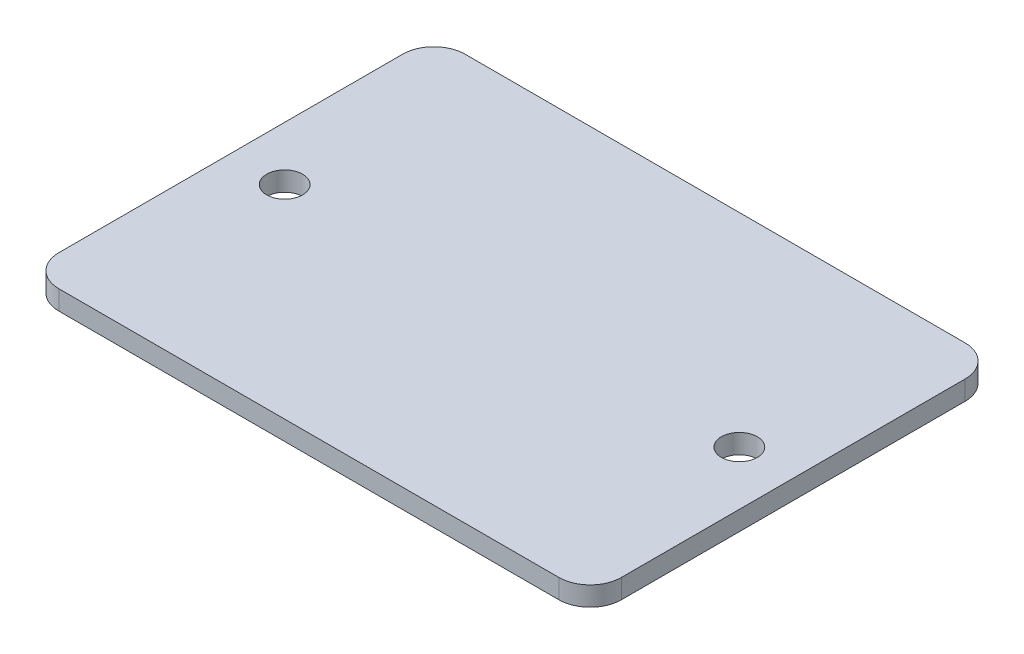
ISO-10303-21;
HEADER;
FILE_DESCRIPTION(('STEP AP214'),'2;1');
FILE_NAME('part.step','',(''),(''),'','','');
FILE_SCHEMA(('AUTOMOTIVE_DESIGN { 1 0 10303 214 1 1 1 1 }'));
ENDSEC;
DATA;
#1=APPLICATION_CONTEXT('core data for automotive mechanical design processes');
#2=APPLICATION_PROTOCOL_DEFINITION('international standard','automotive_design',2000,#1);
#3=PRODUCT_CONTEXT('',#1,'mechanical');
#4=PRODUCT('Part','Part','',(#3));
#5=PRODUCT_RELATED_PRODUCT_CATEGORY('part','',(#4));
#6=PRODUCT_DEFINITION_FORMATION('','',#4);
#7=PRODUCT_DEFINITION_CONTEXT('part definition',#1,'design');
#8=PRODUCT_DEFINITION('design','',#6,#7);
#9=PRODUCT_DEFINITION_SHAPE('','',#8);
#10=(LENGTH_UNIT() NAMED_UNIT(*) SI_UNIT(.MILLI.,.METRE.));
#11=(NAMED_UNIT(*) PLANE_ANGLE_UNIT() SI_UNIT($,.RADIAN.));
#12=(NAMED_UNIT(*) SI_UNIT($,.STERADIAN.) SOLID_ANGLE_UNIT());
#13=UNCERTAINTY_MEASURE_WITH_UNIT(LENGTH_MEASURE(1.E-05),#10,'distance_accuracy_value','');
#14=(GEOMETRIC_REPRESENTATION_CONTEXT(3) GLOBAL_UNCERTAINTY_ASSIGNED_CONTEXT((#13)) GLOBAL_UNIT_ASSIGNED_CONTEXT((#10,
#11,#12)) REPRESENTATION_CONTEXT('',''));
#15=CARTESIAN_POINT('',(0.,0.,0.));
#16=DIRECTION('',(0.,0.,1.));
#17=DIRECTION('',(1.,0.,0.));
#18=AXIS2_PLACEMENT_3D('',#15,#16,#17);
#19=CARTESIAN_POINT('',(-22.86,1.5748,16.51));
#20=DIRECTION('',(1.,0.,0.));
#21=DIRECTION('',(0.,0.,-1.));
#22=AXIS2_PLACEMENT_3D('',#19,#20,#21);
#23=PLANE('',#22);
#24=DIRECTION('',(0.,0.,1.));
#25=VECTOR('',#24,1.);
#26=CARTESIAN_POINT('',(-22.86,1.5748,16.51));
#27=LINE('',#26,#25);
#28=CARTESIAN_POINT('',(-22.86,1.5748,-13.97));
#29=VERTEX_POINT('',#28);
#30=CARTESIAN_POINT('',(-22.86,1.5748,13.97));
#31=VERTEX_POINT('',#30);
#32=EDGE_CURVE('E119',#29,#31,#27,.T.);
#33=ORIENTED_EDGE('',*,*,#32,.F.);
#34=DIRECTION('',(0.,-1.,0.));
#35=VECTOR('',#34,1.);
#36=CARTESIAN_POINT('',(-22.86,1.5748,-13.97));
#37=LINE('',#36,#35);
#38=CARTESIAN_POINT('',(-22.86,0.,-13.97));
#39=VERTEX_POINT('',#38);
#40=EDGE_CURVE('E104',#29,#39,#37,.T.);
#41=ORIENTED_EDGE('',*,*,#40,.T.);
#42=DIRECTION('',(0.,0.,1.));
#43=VECTOR('',#42,1.);
#44=CARTESIAN_POINT('',(-22.86,0.,16.51));
#45=LINE('',#44,#43);
#46=CARTESIAN_POINT('',(-22.86,0.,13.97));
#47=VERTEX_POINT('',#46);
#48=EDGE_CURVE('E116',#39,#47,#45,.T.);
#49=ORIENTED_EDGE('',*,*,#48,.T.);
#50=DIRECTION('',(0.,-1.,0.));
#51=VECTOR('',#50,1.);
#52=CARTESIAN_POINT('',(-22.86,1.5748,13.97));
#53=LINE('',#52,#51);
#54=EDGE_CURVE('E121',#47,#31,#53,.F.);
#55=ORIENTED_EDGE('',*,*,#54,.T.);
#56=EDGE_LOOP('',(#33,#41,#49,#55));
#57=FACE_BOUND('',#56,.T.);
#58=ADVANCED_FACE('F34',(#57),#23,.F.);
#59=CARTESIAN_POINT('',(22.86,1.5748,16.51));
#60=DIRECTION('',(0.,0.,-1.));
#61=DIRECTION('',(-1.,0.,0.));
#62=AXIS2_PLACEMENT_3D('',#59,#60,#61);
#63=PLANE('',#62);
#64=DIRECTION('',(1.,0.,0.));
#65=VECTOR('',#64,1.);
#66=CARTESIAN_POINT('',(22.86,0.,16.51));
#67=LINE('',#66,#65);
#68=CARTESIAN_POINT('',(-20.32,0.,16.51));
#69=VERTEX_POINT('',#68);
#70=CARTESIAN_POINT('',(20.32,0.,16.51));
#71=VERTEX_POINT('',#70);
#72=EDGE_CURVE('E125',#69,#71,#67,.T.);
#73=ORIENTED_EDGE('',*,*,#72,.T.);
#74=DIRECTION('',(0.,-1.,0.));
#75=VECTOR('',#74,1.);
#76=CARTESIAN_POINT('',(20.32,1.5748,16.51));
#77=LINE('',#76,#75);
#78=CARTESIAN_POINT('',(20.32,1.5748,16.51));
#79=VERTEX_POINT('',#78);
#80=EDGE_CURVE('E11',#71,#79,#77,.F.);
#81=ORIENTED_EDGE('',*,*,#80,.T.);
#82=DIRECTION('',(1.,0.,0.));
#83=VECTOR('',#82,1.);
#84=CARTESIAN_POINT('',(22.86,1.5748,16.51));
#85=LINE('',#84,#83);
#86=CARTESIAN_POINT('',(-20.32,1.5748,16.51));
#87=VERTEX_POINT('',#86);
#88=EDGE_CURVE('E165',#87,#79,#85,.T.);
#89=ORIENTED_EDGE('',*,*,#88,.F.);
#90=DIRECTION('',(0.,-1.,0.));
#91=VECTOR('',#90,1.);
#92=CARTESIAN_POINT('',(-20.32,1.5748,16.51));
#93=LINE('',#92,#91);
#94=EDGE_CURVE('E42',#87,#69,#93,.T.);
#95=ORIENTED_EDGE('',*,*,#94,.T.);
#96=EDGE_LOOP('',(#73,#81,#89,#95));
#97=FACE_BOUND('',#96,.T.);
#98=ADVANCED_FACE('F163',(#97),#63,.F.);
#99=CARTESIAN_POINT('',(22.86,1.5748,16.51));
#100=DIRECTION('',(-1.,0.,0.));
#101=DIRECTION('',(0.,0.,1.));
#102=AXIS2_PLACEMENT_3D('',#99,#100,#101);
#103=PLANE('',#102);
#104=DIRECTION('',(0.,0.,-1.));
#105=VECTOR('',#104,1.);
#106=CARTESIAN_POINT('',(22.86,0.,16.51));
#107=LINE('',#106,#105);
#108=CARTESIAN_POINT('',(22.86,0.,13.97));
#109=VERTEX_POINT('',#108);
#110=CARTESIAN_POINT('',(22.86,0.,-13.97));
#111=VERTEX_POINT('',#110);
#112=EDGE_CURVE('E129',#109,#111,#107,.T.);
#113=ORIENTED_EDGE('',*,*,#112,.T.);
#114=DIRECTION('',(0.,-1.,0.));
#115=VECTOR('',#114,1.);
#116=CARTESIAN_POINT('',(22.86,1.5748,-13.97));
#117=LINE('',#116,#115);
#118=CARTESIAN_POINT('',(22.86,1.5748,-13.97));
#119=VERTEX_POINT('',#118);
#120=EDGE_CURVE('E49',#111,#119,#117,.F.);
#121=ORIENTED_EDGE('',*,*,#120,.T.);
#122=DIRECTION('',(0.,0.,-1.));
#123=VECTOR('',#122,1.);
#124=CARTESIAN_POINT('',(22.86,1.5748,16.51));
#125=LINE('',#124,#123);
#126=CARTESIAN_POINT('',(22.86,1.5748,13.97));
#127=VERTEX_POINT('',#126);
#128=EDGE_CURVE('E173',#127,#119,#125,.T.);
#129=ORIENTED_EDGE('',*,*,#128,.F.);
#130=DIRECTION('',(0.,-1.,0.));
#131=VECTOR('',#130,1.);
#132=CARTESIAN_POINT('',(22.86,1.5748,13.97));
#133=LINE('',#132,#131);
#134=EDGE_CURVE('E156',#127,#109,#133,.T.);
#135=ORIENTED_EDGE('',*,*,#134,.T.);
#136=EDGE_LOOP('',(#113,#121,#129,#135));
#137=FACE_BOUND('',#136,.T.);
#138=ADVANCED_FACE('F172',(#137),#103,.F.);
#139=CARTESIAN_POINT('',(22.86,1.5748,-16.51));
#140=DIRECTION('',(0.,0.,1.));
#141=DIRECTION('',(1.,0.,0.));
#142=AXIS2_PLACEMENT_3D('',#139,#140,#141);
#143=PLANE('',#142);
#144=DIRECTION('',(-1.,0.,0.));
#145=VECTOR('',#144,1.);
#146=CARTESIAN_POINT('',(22.86,0.,-16.51));
#147=LINE('',#146,#145);
#148=CARTESIAN_POINT('',(20.32,0.,-16.51));
#149=VERTEX_POINT('',#148);
#150=CARTESIAN_POINT('',(-20.32,0.,-16.51));
#151=VERTEX_POINT('',#150);
#152=EDGE_CURVE('E139',#149,#151,#147,.T.);
#153=ORIENTED_EDGE('',*,*,#152,.T.);
#154=DIRECTION('',(0.,-1.,0.));
#155=VECTOR('',#154,1.);
#156=CARTESIAN_POINT('',(-20.32,1.5748,-16.51));
#157=LINE('',#156,#155);
#158=CARTESIAN_POINT('',(-20.32,1.5748,-16.51));
#159=VERTEX_POINT('',#158);
#160=EDGE_CURVE('E105',#151,#159,#157,.F.);
#161=ORIENTED_EDGE('',*,*,#160,.T.);
#162=DIRECTION('',(-1.,0.,0.));
#163=VECTOR('',#162,1.);
#164=CARTESIAN_POINT('',(22.86,1.5748,-16.51));
#165=LINE('',#164,#163);
#166=CARTESIAN_POINT('',(20.32,1.5748,-16.51));
#167=VERTEX_POINT('',#166);
#168=EDGE_CURVE('E135',#167,#159,#165,.T.);
#169=ORIENTED_EDGE('',*,*,#168,.F.);
#170=DIRECTION('',(0.,-1.,0.));
#171=VECTOR('',#170,1.);
#172=CARTESIAN_POINT('',(20.32,1.5748,-16.51));
#173=LINE('',#172,#171);
#174=EDGE_CURVE('E110',#167,#149,#173,.T.);
#175=ORIENTED_EDGE('',*,*,#174,.T.);
#176=EDGE_LOOP('',(#153,#161,#169,#175));
#177=FACE_BOUND('',#176,.T.);
#178=ADVANCED_FACE('F193',(#177),#143,.F.);
#179=CARTESIAN_POINT('',(0.,1.5748,0.));
#180=DIRECTION('',(0.,1.,0.));
#181=DIRECTION('',(0.,0.,1.));
#182=AXIS2_PLACEMENT_3D('',#179,#180,#181);
#183=PLANE('',#182);
#184=CARTESIAN_POINT('',(-18.4785,1.5748,0.));
#185=DIRECTION('',(0.,1.,0.));
#186=DIRECTION('',(0.,0.,1.));
#187=AXIS2_PLACEMENT_3D('',#184,#185,#186);
#188=CIRCLE('',#187,1.4605);
#189=CARTESIAN_POINT('',(-18.4785,1.5748,1.4605));
#190=VERTEX_POINT('',#189);
#191=EDGE_CURVE('E132',#190,#190,#188,.T.);
#192=ORIENTED_EDGE('',*,*,#191,.F.);
#193=EDGE_LOOP('',(#192));
#194=FACE_BOUND('',#193,.T.);
#195=CARTESIAN_POINT('',(18.4785,1.5748,0.));
#196=DIRECTION('',(0.,1.,0.));
#197=DIRECTION('',(0.,0.,1.));
#198=AXIS2_PLACEMENT_3D('',#195,#196,#197);
#199=CIRCLE('',#198,1.4605);
#200=CARTESIAN_POINT('',(18.4785,1.5748,1.4605));
#201=VERTEX_POINT('',#200);
#202=EDGE_CURVE('E179',#201,#201,#199,.T.);
#203=ORIENTED_EDGE('',*,*,#202,.F.);
#204=EDGE_LOOP('',(#203));
#205=FACE_BOUND('',#204,.T.);
#206=ORIENTED_EDGE('',*,*,#168,.T.);
#207=CARTESIAN_POINT('',(-20.32,1.5748,-13.97));
#208=DIRECTION('',(0.,1.,0.));
#209=DIRECTION('',(0.,0.,1.));
#210=AXIS2_PLACEMENT_3D('',#207,#208,#209);
#211=CIRCLE('',#210,2.54);
#212=EDGE_CURVE('E154',#159,#29,#211,.T.);
#213=ORIENTED_EDGE('',*,*,#212,.T.);
#214=ORIENTED_EDGE('',*,*,#32,.T.);
#215=CARTESIAN_POINT('',(-20.32,1.5748,13.97));
#216=DIRECTION('',(0.,1.,0.));
#217=DIRECTION('',(0.,0.,1.));
#218=AXIS2_PLACEMENT_3D('',#215,#216,#217);
#219=CIRCLE('',#218,2.54);
#220=EDGE_CURVE('E149',#31,#87,#219,.T.);
#221=ORIENTED_EDGE('',*,*,#220,.T.);
#222=ORIENTED_EDGE('',*,*,#88,.T.);
#223=CARTESIAN_POINT('',(20.32,1.5748,13.97));
#224=DIRECTION('',(0.,1.,0.));
#225=DIRECTION('',(0.,0.,1.));
#226=AXIS2_PLACEMENT_3D('',#223,#224,#225);
#227=CIRCLE('',#226,2.54);
#228=EDGE_CURVE('E56',#79,#127,#227,.T.);
#229=ORIENTED_EDGE('',*,*,#228,.T.);
#230=ORIENTED_EDGE('',*,*,#128,.T.);
#231=CARTESIAN_POINT('',(20.32,1.5748,-13.97));
#232=DIRECTION('',(0.,1.,0.));
#233=DIRECTION('',(0.,0.,1.));
#234=AXIS2_PLACEMENT_3D('',#231,#232,#233);
#235=CIRCLE('',#234,2.54);
#236=EDGE_CURVE('E152',#119,#167,#235,.T.);
#237=ORIENTED_EDGE('',*,*,#236,.T.);
#238=EDGE_LOOP('',(#206,#213,#214,#221,#222,#229,#230,#237));
#239=FACE_BOUND('',#238,.T.);
#240=ADVANCED_FACE('F190',(#194,#205,#239),#183,.T.);
#241=CARTESIAN_POINT('',(0.,0.,0.));
#242=DIRECTION('',(0.,1.,0.));
#243=DIRECTION('',(0.,0.,1.));
#244=AXIS2_PLACEMENT_3D('',#241,#242,#243);
#245=PLANE('',#244);
#246=CARTESIAN_POINT('',(-18.4785,0.,0.));
#247=DIRECTION('',(0.,1.,0.));
#248=DIRECTION('',(0.,0.,1.));
#249=AXIS2_PLACEMENT_3D('',#246,#247,#248);
#250=CIRCLE('',#249,1.4605);
#251=CARTESIAN_POINT('',(-18.4785,0.,1.4605));
#252=VERTEX_POINT('',#251);
#253=EDGE_CURVE('E126',#252,#252,#250,.T.);
#254=ORIENTED_EDGE('',*,*,#253,.T.);
#255=EDGE_LOOP('',(#254));
#256=FACE_BOUND('',#255,.T.);
#257=CARTESIAN_POINT('',(18.4785,0.,0.));
#258=DIRECTION('',(0.,1.,0.));
#259=DIRECTION('',(0.,0.,1.));
#260=AXIS2_PLACEMENT_3D('',#257,#258,#259);
#261=CIRCLE('',#260,1.4605);
#262=CARTESIAN_POINT('',(18.4785,0.,1.4605));
#263=VERTEX_POINT('',#262);
#264=EDGE_CURVE('E182',#263,#263,#261,.T.);
#265=ORIENTED_EDGE('',*,*,#264,.T.);
#266=EDGE_LOOP('',(#265));
#267=FACE_BOUND('',#266,.T.);
#268=ORIENTED_EDGE('',*,*,#48,.F.);
#269=CARTESIAN_POINT('',(-20.32,0.,-13.97));
#270=DIRECTION('',(0.,1.,0.));
#271=DIRECTION('',(0.,0.,1.));
#272=AXIS2_PLACEMENT_3D('',#269,#270,#271);
#273=CIRCLE('',#272,2.54);
#274=EDGE_CURVE('E100',#39,#151,#273,.F.);
#275=ORIENTED_EDGE('',*,*,#274,.T.);
#276=ORIENTED_EDGE('',*,*,#152,.F.);
#277=CARTESIAN_POINT('',(20.32,0.,-13.97));
#278=DIRECTION('',(0.,1.,0.));
#279=DIRECTION('',(0.,0.,1.));
#280=AXIS2_PLACEMENT_3D('',#277,#278,#279);
#281=CIRCLE('',#280,2.54);
#282=EDGE_CURVE('E111',#149,#111,#281,.F.);
#283=ORIENTED_EDGE('',*,*,#282,.T.);
#284=ORIENTED_EDGE('',*,*,#112,.F.);
#285=CARTESIAN_POINT('',(20.32,0.,13.97));
#286=DIRECTION('',(0.,1.,0.));
#287=DIRECTION('',(0.,0.,1.));
#288=AXIS2_PLACEMENT_3D('',#285,#286,#287);
#289=CIRCLE('',#288,2.54);
#290=EDGE_CURVE('E143',#109,#71,#289,.F.);
#291=ORIENTED_EDGE('',*,*,#290,.T.);
#292=ORIENTED_EDGE('',*,*,#72,.F.);
#293=CARTESIAN_POINT('',(-20.32,0.,13.97));
#294=DIRECTION('',(0.,1.,0.));
#295=DIRECTION('',(0.,0.,1.));
#296=AXIS2_PLACEMENT_3D('',#293,#294,#295);
#297=CIRCLE('',#296,2.54);
#298=EDGE_CURVE('E120',#69,#47,#297,.F.);
#299=ORIENTED_EDGE('',*,*,#298,.T.);
#300=EDGE_LOOP('',(#268,#275,#276,#283,#284,#291,#292,#299));
#301=FACE_BOUND('',#300,.T.);
#302=ADVANCED_FACE('F123',(#256,#267,#301),#245,.F.);
#303=CARTESIAN_POINT('',(-20.32,1.5748,-13.97));
#304=DIRECTION('',(0.,-1.,0.));
#305=DIRECTION('',(0.,0.,-1.));
#306=AXIS2_PLACEMENT_3D('',#303,#304,#305);
#307=CYLINDRICAL_SURFACE('',#306,2.54);
#308=ORIENTED_EDGE('',*,*,#212,.F.);
#309=ORIENTED_EDGE('',*,*,#160,.F.);
#310=ORIENTED_EDGE('',*,*,#274,.F.);
#311=ORIENTED_EDGE('',*,*,#40,.F.);
#312=EDGE_LOOP('',(#308,#309,#310,#311));
#313=FACE_BOUND('',#312,.T.);
#314=ADVANCED_FACE('F103',(#313),#307,.T.);
#315=CARTESIAN_POINT('',(20.32,1.5748,-13.97));
#316=DIRECTION('',(0.,-1.,0.));
#317=DIRECTION('',(0.,0.,-1.));
#318=AXIS2_PLACEMENT_3D('',#315,#316,#317);
#319=CYLINDRICAL_SURFACE('',#318,2.54);
#320=ORIENTED_EDGE('',*,*,#236,.F.);
#321=ORIENTED_EDGE('',*,*,#120,.F.);
#322=ORIENTED_EDGE('',*,*,#282,.F.);
#323=ORIENTED_EDGE('',*,*,#174,.F.);
#324=EDGE_LOOP('',(#320,#321,#322,#323));
#325=FACE_BOUND('',#324,.T.);
#326=ADVANCED_FACE('F200',(#325),#319,.T.);
#327=CARTESIAN_POINT('',(20.32,1.5748,13.97));
#328=DIRECTION('',(0.,-1.,0.));
#329=DIRECTION('',(0.,0.,-1.));
#330=AXIS2_PLACEMENT_3D('',#327,#328,#329);
#331=CYLINDRICAL_SURFACE('',#330,2.54);
#332=ORIENTED_EDGE('',*,*,#228,.F.);
#333=ORIENTED_EDGE('',*,*,#80,.F.);
#334=ORIENTED_EDGE('',*,*,#290,.F.);
#335=ORIENTED_EDGE('',*,*,#134,.F.);
#336=EDGE_LOOP('',(#332,#333,#334,#335));
#337=FACE_BOUND('',#336,.T.);
#338=ADVANCED_FACE('F171',(#337),#331,.T.);
#339=CARTESIAN_POINT('',(-20.32,1.5748,13.97));
#340=DIRECTION('',(0.,-1.,0.));
#341=DIRECTION('',(0.,0.,-1.));
#342=AXIS2_PLACEMENT_3D('',#339,#340,#341);
#343=CYLINDRICAL_SURFACE('',#342,2.54);
#344=ORIENTED_EDGE('',*,*,#220,.F.);
#345=ORIENTED_EDGE('',*,*,#54,.F.);
#346=ORIENTED_EDGE('',*,*,#298,.F.);
#347=ORIENTED_EDGE('',*,*,#94,.F.);
#348=EDGE_LOOP('',(#344,#345,#346,#347));
#349=FACE_BOUND('',#348,.T.);
#350=ADVANCED_FACE('F36',(#349),#343,.T.);
#351=CARTESIAN_POINT('',(18.4785,0.,0.));
#352=DIRECTION('',(0.,1.,0.));
#353=DIRECTION('',(0.,0.,1.));
#354=AXIS2_PLACEMENT_3D('',#351,#352,#353);
#355=CYLINDRICAL_SURFACE('',#354,1.4605);
#356=ORIENTED_EDGE('',*,*,#264,.F.);
#357=EDGE_LOOP('',(#356));
#358=FACE_BOUND('',#357,.T.);
#359=ORIENTED_EDGE('',*,*,#202,.T.);
#360=EDGE_LOOP('',(#359));
#361=FACE_BOUND('',#360,.T.);
#362=ADVANCED_FACE('F222',(#358,#361),#355,.F.);
#363=CARTESIAN_POINT('',(-18.4785,0.,0.));
#364=DIRECTION('',(0.,1.,0.));
#365=DIRECTION('',(0.,0.,1.));
#366=AXIS2_PLACEMENT_3D('',#363,#364,#365);
#367=CYLINDRICAL_SURFACE('',#366,1.4605);
#368=ORIENTED_EDGE('',*,*,#253,.F.);
#369=EDGE_LOOP('',(#368));
#370=FACE_BOUND('',#369,.T.);
#371=ORIENTED_EDGE('',*,*,#191,.T.);
#372=EDGE_LOOP('',(#371));
#373=FACE_BOUND('',#372,.T.);
#374=ADVANCED_FACE('F188',(#370,#373),#367,.F.);
#375=CLOSED_SHELL('',(#58,#98,#138,#178,#240,#302,#314,#326,#338,#350,#362,#374));
#376=MANIFOLD_SOLID_BREP('B2',#375);
#377=ADVANCED_BREP_SHAPE_REPRESENTATION('',(#18,#376),#14);
#378=SHAPE_DEFINITION_REPRESENTATION(#9,#377);
ENDSEC;
END-ISO-10303-21;
